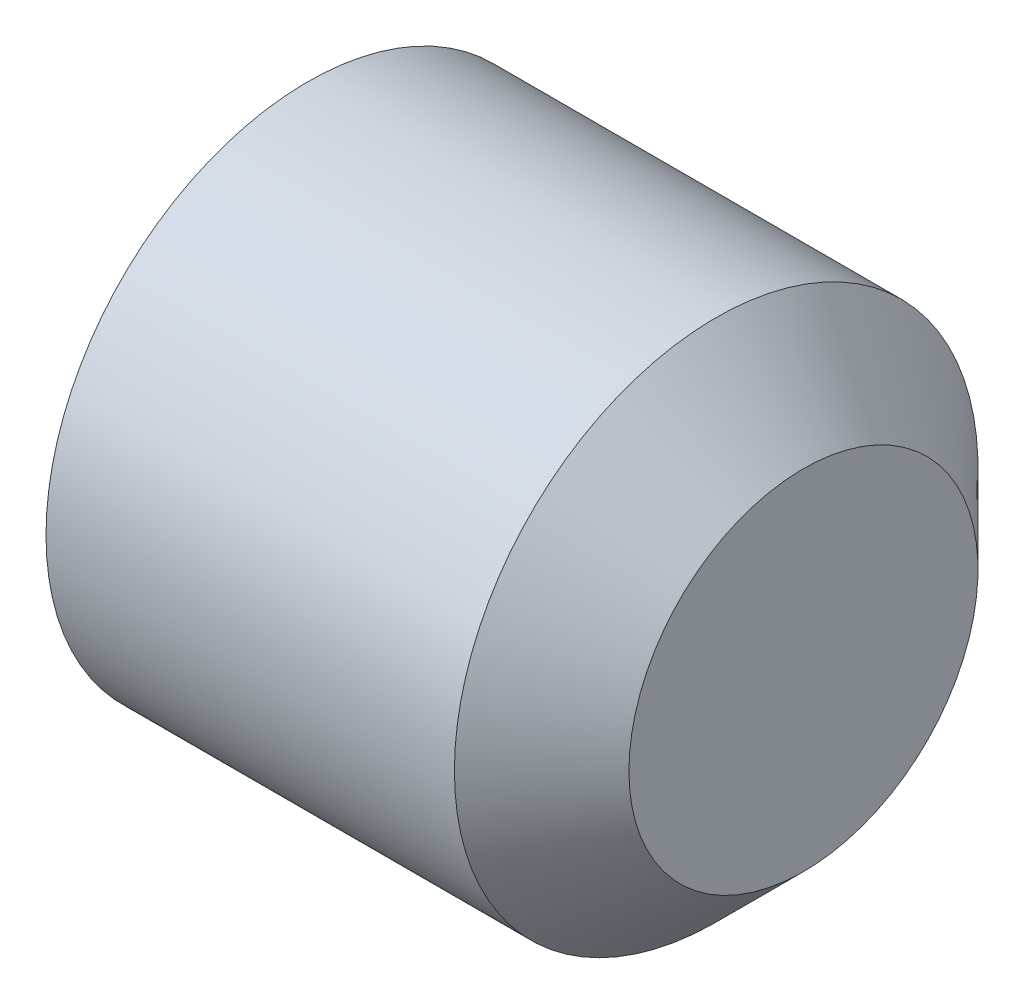
ISO-10303-21;
HEADER;
FILE_DESCRIPTION(('STEP AP214'),'2;1');
FILE_NAME('part.step','',(''),(''),'','','');
FILE_SCHEMA(('AUTOMOTIVE_DESIGN { 1 0 10303 214 1 1 1 1 }'));
ENDSEC;
DATA;
#1=APPLICATION_CONTEXT('core data for automotive mechanical design processes');
#2=APPLICATION_PROTOCOL_DEFINITION('international standard','automotive_design',2000,#1);
#3=PRODUCT_CONTEXT('',#1,'mechanical');
#4=PRODUCT('Part','Part','',(#3));
#5=PRODUCT_RELATED_PRODUCT_CATEGORY('part','',(#4));
#6=PRODUCT_DEFINITION_FORMATION('','',#4);
#7=PRODUCT_DEFINITION_CONTEXT('part definition',#1,'design');
#8=PRODUCT_DEFINITION('design','',#6,#7);
#9=PRODUCT_DEFINITION_SHAPE('','',#8);
#10=(LENGTH_UNIT() NAMED_UNIT(*) SI_UNIT(.MILLI.,.METRE.));
#11=(NAMED_UNIT(*) PLANE_ANGLE_UNIT() SI_UNIT($,.RADIAN.));
#12=(NAMED_UNIT(*) SI_UNIT($,.STERADIAN.) SOLID_ANGLE_UNIT());
#13=UNCERTAINTY_MEASURE_WITH_UNIT(LENGTH_MEASURE(1.E-05),#10,'distance_accuracy_value','');
#14=(GEOMETRIC_REPRESENTATION_CONTEXT(3) GLOBAL_UNCERTAINTY_ASSIGNED_CONTEXT((#13)) GLOBAL_UNIT_ASSIGNED_CONTEXT((#10,
#11,#12)) REPRESENTATION_CONTEXT('',''));
#15=CARTESIAN_POINT('',(0.,0.,0.));
#16=DIRECTION('',(0.,0.,1.));
#17=DIRECTION('',(1.,0.,0.));
#18=AXIS2_PLACEMENT_3D('',#15,#16,#17);
#19=CARTESIAN_POINT('',(0.,0.,0.));
#20=DIRECTION('',(-1.,0.,0.));
#21=DIRECTION('',(0.,0.,1.));
#22=AXIS2_PLACEMENT_3D('',#19,#20,#21);
#23=PLANE('',#22);
#24=CARTESIAN_POINT('',(0.,0.,0.));
#25=DIRECTION('',(-1.,0.,0.));
#26=DIRECTION('',(0.,0.,1.));
#27=AXIS2_PLACEMENT_3D('',#24,#25,#26);
#28=CIRCLE('',#27,2.44550000002553);
#29=CARTESIAN_POINT('',(0.,0.,2.44550000002553));
#30=VERTEX_POINT('',#29);
#31=EDGE_CURVE('E45',#30,#30,#28,.T.);
#32=ORIENTED_EDGE('',*,*,#31,.T.);
#33=EDGE_LOOP('',(#32));
#34=FACE_BOUND('',#33,.T.);
#35=DIRECTION('',(0.,0.866025403784439,0.5));
#36=VECTOR('',#35,1.);
#37=CARTESIAN_POINT('',(0.,-1.49999999999999,0.866025403784435));
#38=LINE('',#37,#36);
#39=CARTESIAN_POINT('',(0.,-1.49999999999999,0.866025403784435));
#40=VERTEX_POINT('',#39);
#41=CARTESIAN_POINT('',(0.,0.,1.73205080756887));
#42=VERTEX_POINT('',#41);
#43=EDGE_CURVE('E52',#40,#42,#38,.T.);
#44=ORIENTED_EDGE('',*,*,#43,.F.);
#45=DIRECTION('',(0.,0.,1.));
#46=VECTOR('',#45,1.);
#47=CARTESIAN_POINT('',(0.,-1.49999999999999,-0.866025403784441));
#48=LINE('',#47,#46);
#49=CARTESIAN_POINT('',(0.,-1.49999999999999,-0.866025403784441));
#50=VERTEX_POINT('',#49);
#51=EDGE_CURVE('E135',#50,#40,#48,.T.);
#52=ORIENTED_EDGE('',*,*,#51,.F.);
#53=DIRECTION('',(0.,-0.866025403784438,0.500000000000001));
#54=VECTOR('',#53,1.);
#55=CARTESIAN_POINT('',(0.,0.,-1.73205080756888));
#56=LINE('',#55,#54);
#57=CARTESIAN_POINT('',(0.,0.,-1.73205080756888));
#58=VERTEX_POINT('',#57);
#59=EDGE_CURVE('E133',#58,#50,#56,.T.);
#60=ORIENTED_EDGE('',*,*,#59,.F.);
#61=DIRECTION('',(0.,-0.866025403784439,-0.5));
#62=VECTOR('',#61,1.);
#63=CARTESIAN_POINT('',(0.,1.5,-0.866025403784442));
#64=LINE('',#63,#62);
#65=CARTESIAN_POINT('',(0.,1.5,-0.866025403784442));
#66=VERTEX_POINT('',#65);
#67=EDGE_CURVE('E100',#66,#58,#64,.T.);
#68=ORIENTED_EDGE('',*,*,#67,.F.);
#69=DIRECTION('',(0.,0.,-1.));
#70=VECTOR('',#69,1.);
#71=CARTESIAN_POINT('',(0.,1.5,0.866025403784434));
#72=LINE('',#71,#70);
#73=CARTESIAN_POINT('',(0.,1.5,0.866025403784434));
#74=VERTEX_POINT('',#73);
#75=EDGE_CURVE('E129',#74,#66,#72,.T.);
#76=ORIENTED_EDGE('',*,*,#75,.F.);
#77=DIRECTION('',(0.,0.866025403784438,-0.5));
#78=VECTOR('',#77,1.);
#79=CARTESIAN_POINT('',(0.,0.,1.73205080756887));
#80=LINE('',#79,#78);
#81=EDGE_CURVE('E126',#42,#74,#80,.T.);
#82=ORIENTED_EDGE('',*,*,#81,.F.);
#83=EDGE_LOOP('',(#44,#52,#60,#68,#76,#82));
#84=FACE_BOUND('',#83,.T.);
#85=ADVANCED_FACE('F37',(#34,#84),#23,.T.);
#86=CARTESIAN_POINT('',(6.,0.,0.));
#87=DIRECTION('',(-1.,0.,0.));
#88=DIRECTION('',(0.,0.,1.));
#89=AXIS2_PLACEMENT_3D('',#86,#87,#88);
#90=CYLINDRICAL_SURFACE('',#89,3.00000000000659);
#91=CARTESIAN_POINT('',(0.320140724260976,0.,0.));
#92=DIRECTION('',(-1.,0.,0.));
#93=DIRECTION('',(0.,0.,1.));
#94=AXIS2_PLACEMENT_3D('',#91,#92,#93);
#95=CIRCLE('',#94,3.00000000000659);
#96=CARTESIAN_POINT('',(0.320140724260976,0.,3.00000000000659));
#97=VERTEX_POINT('',#96);
#98=EDGE_CURVE('E11',#97,#97,#95,.F.);
#99=ORIENTED_EDGE('',*,*,#98,.T.);
#100=EDGE_LOOP('',(#99));
#101=FACE_BOUND('',#100,.T.);
#102=CARTESIAN_POINT('',(4.99999999999341,0.,0.));
#103=DIRECTION('',(-1.,0.,0.));
#104=DIRECTION('',(0.,0.,1.));
#105=AXIS2_PLACEMENT_3D('',#102,#103,#104);
#106=CIRCLE('',#105,3.00000000000659);
#107=CARTESIAN_POINT('',(4.99999999999341,0.,3.00000000000659));
#108=VERTEX_POINT('',#107);
#109=EDGE_CURVE('E147',#108,#108,#106,.T.);
#110=ORIENTED_EDGE('',*,*,#109,.T.);
#111=EDGE_LOOP('',(#110));
#112=FACE_BOUND('',#111,.T.);
#113=ADVANCED_FACE('F163',(#101,#112),#90,.T.);
#114=CARTESIAN_POINT('',(4.99999999999341,0.,0.));
#115=DIRECTION('',(-1.,0.,0.));
#116=DIRECTION('',(0.,0.,1.));
#117=AXIS2_PLACEMENT_3D('',#114,#115,#116);
#118=CONICAL_SURFACE('',#117,3.00000000000659,0.78539816339745);
#119=CARTESIAN_POINT('',(6.,0.,0.));
#120=DIRECTION('',(-1.,0.,0.));
#121=DIRECTION('',(0.,0.,1.));
#122=AXIS2_PLACEMENT_3D('',#119,#120,#121);
#123=CIRCLE('',#122,2.);
#124=CARTESIAN_POINT('',(6.,0.,2.));
#125=VERTEX_POINT('',#124);
#126=EDGE_CURVE('E139',#125,#125,#123,.T.);
#127=ORIENTED_EDGE('',*,*,#126,.T.);
#128=EDGE_LOOP('',(#127));
#129=FACE_BOUND('',#128,.T.);
#130=ORIENTED_EDGE('',*,*,#109,.F.);
#131=EDGE_LOOP('',(#130));
#132=FACE_BOUND('',#131,.T.);
#133=ADVANCED_FACE('F167',(#129,#132),#118,.T.);
#134=CARTESIAN_POINT('',(6.,2.,0.));
#135=DIRECTION('',(1.,0.,0.));
#136=DIRECTION('',(0.,0.,-1.));
#137=AXIS2_PLACEMENT_3D('',#134,#135,#136);
#138=PLANE('',#137);
#139=ORIENTED_EDGE('',*,*,#126,.F.);
#140=EDGE_LOOP('',(#139));
#141=FACE_BOUND('',#140,.T.);
#142=ADVANCED_FACE('F173',(#141),#138,.T.);
#143=CARTESIAN_POINT('',(2.,-1.49999999999999,0.866025403784435));
#144=DIRECTION('',(0.,-0.5,0.866025403784439));
#145=DIRECTION('',(0.,-0.866025403784439,-0.5));
#146=AXIS2_PLACEMENT_3D('',#143,#144,#145);
#147=PLANE('',#146);
#148=ORIENTED_EDGE('',*,*,#43,.T.);
#149=DIRECTION('',(-1.,0.,0.));
#150=VECTOR('',#149,1.);
#151=CARTESIAN_POINT('',(2.,0.,1.73205080756887));
#152=LINE('',#151,#150);
#153=CARTESIAN_POINT('',(2.,0.,1.73205080756887));
#154=VERTEX_POINT('',#153);
#155=EDGE_CURVE('E82',#154,#42,#152,.T.);
#156=ORIENTED_EDGE('',*,*,#155,.F.);
#157=DIRECTION('',(0.,0.866025403784439,0.5));
#158=VECTOR('',#157,1.);
#159=CARTESIAN_POINT('',(2.,-1.49999999999999,0.866025403784435));
#160=LINE('',#159,#158);
#161=CARTESIAN_POINT('',(2.,-1.49999999999999,0.866025403784435));
#162=VERTEX_POINT('',#161);
#163=EDGE_CURVE('E137',#162,#154,#160,.T.);
#164=ORIENTED_EDGE('',*,*,#163,.F.);
#165=DIRECTION('',(-1.,0.,0.));
#166=VECTOR('',#165,1.);
#167=CARTESIAN_POINT('',(2.,-1.49999999999999,0.866025403784435));
#168=LINE('',#167,#166);
#169=EDGE_CURVE('E60',#162,#40,#168,.T.);
#170=ORIENTED_EDGE('',*,*,#169,.T.);
#171=EDGE_LOOP('',(#148,#156,#164,#170));
#172=FACE_BOUND('',#171,.T.);
#173=ADVANCED_FACE('F177',(#172),#147,.F.);
#174=CARTESIAN_POINT('',(2.,-1.49999999999999,-0.866025403784441));
#175=DIRECTION('',(0.,-1.,0.));
#176=DIRECTION('',(0.,0.,-1.));
#177=AXIS2_PLACEMENT_3D('',#174,#175,#176);
#178=PLANE('',#177);
#179=ORIENTED_EDGE('',*,*,#51,.T.);
#180=ORIENTED_EDGE('',*,*,#169,.F.);
#181=DIRECTION('',(0.,0.,1.));
#182=VECTOR('',#181,1.);
#183=CARTESIAN_POINT('',(2.,-1.49999999999999,-0.866025403784441));
#184=LINE('',#183,#182);
#185=CARTESIAN_POINT('',(2.,-1.49999999999999,-0.866025403784441));
#186=VERTEX_POINT('',#185);
#187=EDGE_CURVE('E112',#186,#162,#184,.T.);
#188=ORIENTED_EDGE('',*,*,#187,.F.);
#189=DIRECTION('',(-1.,0.,0.));
#190=VECTOR('',#189,1.);
#191=CARTESIAN_POINT('',(2.,-1.49999999999999,-0.866025403784441));
#192=LINE('',#191,#190);
#193=EDGE_CURVE('E104',#186,#50,#192,.T.);
#194=ORIENTED_EDGE('',*,*,#193,.T.);
#195=EDGE_LOOP('',(#179,#180,#188,#194));
#196=FACE_BOUND('',#195,.T.);
#197=ADVANCED_FACE('F181',(#196),#178,.F.);
#198=CARTESIAN_POINT('',(2.,0.,-1.73205080756888));
#199=DIRECTION('',(0.,-0.500000000000001,-0.866025403784438));
#200=DIRECTION('',(0.,0.866025403784438,-0.500000000000001));
#201=AXIS2_PLACEMENT_3D('',#198,#199,#200);
#202=PLANE('',#201);
#203=ORIENTED_EDGE('',*,*,#59,.T.);
#204=ORIENTED_EDGE('',*,*,#193,.F.);
#205=DIRECTION('',(0.,-0.866025403784438,0.500000000000001));
#206=VECTOR('',#205,1.);
#207=CARTESIAN_POINT('',(2.,0.,-1.73205080756888));
#208=LINE('',#207,#206);
#209=CARTESIAN_POINT('',(2.,0.,-1.73205080756888));
#210=VERTEX_POINT('',#209);
#211=EDGE_CURVE('E108',#210,#186,#208,.T.);
#212=ORIENTED_EDGE('',*,*,#211,.F.);
#213=DIRECTION('',(-1.,0.,0.));
#214=VECTOR('',#213,1.);
#215=CARTESIAN_POINT('',(2.,0.,-1.73205080756888));
#216=LINE('',#215,#214);
#217=EDGE_CURVE('E93',#210,#58,#216,.T.);
#218=ORIENTED_EDGE('',*,*,#217,.T.);
#219=EDGE_LOOP('',(#203,#204,#212,#218));
#220=FACE_BOUND('',#219,.T.);
#221=ADVANCED_FACE('F109',(#220),#202,.F.);
#222=CARTESIAN_POINT('',(2.,1.5,-0.866025403784442));
#223=DIRECTION('',(0.,0.5,-0.866025403784439));
#224=DIRECTION('',(0.,0.866025403784439,0.5));
#225=AXIS2_PLACEMENT_3D('',#222,#223,#224);
#226=PLANE('',#225);
#227=ORIENTED_EDGE('',*,*,#67,.T.);
#228=ORIENTED_EDGE('',*,*,#217,.F.);
#229=DIRECTION('',(0.,-0.866025403784439,-0.5));
#230=VECTOR('',#229,1.);
#231=CARTESIAN_POINT('',(2.,1.5,-0.866025403784442));
#232=LINE('',#231,#230);
#233=CARTESIAN_POINT('',(2.,1.5,-0.866025403784442));
#234=VERTEX_POINT('',#233);
#235=EDGE_CURVE('E97',#234,#210,#232,.T.);
#236=ORIENTED_EDGE('',*,*,#235,.F.);
#237=DIRECTION('',(-1.,0.,0.));
#238=VECTOR('',#237,1.);
#239=CARTESIAN_POINT('',(2.,1.5,-0.866025403784442));
#240=LINE('',#239,#238);
#241=EDGE_CURVE('E105',#234,#66,#240,.T.);
#242=ORIENTED_EDGE('',*,*,#241,.T.);
#243=EDGE_LOOP('',(#227,#228,#236,#242));
#244=FACE_BOUND('',#243,.T.);
#245=ADVANCED_FACE('F95',(#244),#226,.F.);
#246=CARTESIAN_POINT('',(2.,1.5,0.866025403784434));
#247=DIRECTION('',(0.,1.,0.));
#248=DIRECTION('',(0.,0.,1.));
#249=AXIS2_PLACEMENT_3D('',#246,#247,#248);
#250=PLANE('',#249);
#251=ORIENTED_EDGE('',*,*,#75,.T.);
#252=ORIENTED_EDGE('',*,*,#241,.F.);
#253=DIRECTION('',(0.,0.,-1.));
#254=VECTOR('',#253,1.);
#255=CARTESIAN_POINT('',(2.,1.5,0.866025403784434));
#256=LINE('',#255,#254);
#257=CARTESIAN_POINT('',(2.,1.5,0.866025403784434));
#258=VERTEX_POINT('',#257);
#259=EDGE_CURVE('E118',#258,#234,#256,.T.);
#260=ORIENTED_EDGE('',*,*,#259,.F.);
#261=DIRECTION('',(-1.,0.,0.));
#262=VECTOR('',#261,1.);
#263=CARTESIAN_POINT('',(2.,1.5,0.866025403784434));
#264=LINE('',#263,#262);
#265=EDGE_CURVE('E142',#258,#74,#264,.T.);
#266=ORIENTED_EDGE('',*,*,#265,.T.);
#267=EDGE_LOOP('',(#251,#252,#260,#266));
#268=FACE_BOUND('',#267,.T.);
#269=ADVANCED_FACE('F184',(#268),#250,.F.);
#270=CARTESIAN_POINT('',(2.,0.,1.73205080756887));
#271=DIRECTION('',(0.,0.5,0.866025403784438));
#272=DIRECTION('',(0.,-0.866025403784438,0.5));
#273=AXIS2_PLACEMENT_3D('',#270,#271,#272);
#274=PLANE('',#273);
#275=ORIENTED_EDGE('',*,*,#81,.T.);
#276=ORIENTED_EDGE('',*,*,#265,.F.);
#277=DIRECTION('',(0.,0.866025403784438,-0.5));
#278=VECTOR('',#277,1.);
#279=CARTESIAN_POINT('',(2.,0.,1.73205080756887));
#280=LINE('',#279,#278);
#281=EDGE_CURVE('E120',#154,#258,#280,.T.);
#282=ORIENTED_EDGE('',*,*,#281,.F.);
#283=ORIENTED_EDGE('',*,*,#155,.T.);
#284=EDGE_LOOP('',(#275,#276,#282,#283));
#285=FACE_BOUND('',#284,.T.);
#286=ADVANCED_FACE('F159',(#285),#274,.F.);
#287=CARTESIAN_POINT('',(2.,0.,0.));
#288=DIRECTION('',(-1.,0.,0.));
#289=DIRECTION('',(0.,0.,1.));
#290=AXIS2_PLACEMENT_3D('',#287,#288,#289);
#291=PLANE('',#290);
#292=ORIENTED_EDGE('',*,*,#163,.T.);
#293=ORIENTED_EDGE('',*,*,#281,.T.);
#294=ORIENTED_EDGE('',*,*,#259,.T.);
#295=ORIENTED_EDGE('',*,*,#235,.T.);
#296=ORIENTED_EDGE('',*,*,#211,.T.);
#297=ORIENTED_EDGE('',*,*,#187,.T.);
#298=EDGE_LOOP('',(#292,#293,#294,#295,#296,#297));
#299=FACE_BOUND('',#298,.T.);
#300=ADVANCED_FACE('F115',(#299),#291,.T.);
#301=CARTESIAN_POINT('',(0.,0.,0.));
#302=DIRECTION('',(1.,0.,0.));
#303=DIRECTION('',(0.,0.,-1.));
#304=AXIS2_PLACEMENT_3D('',#301,#302,#303);
#305=CONICAL_SURFACE('',#304,2.44550000002553,1.04719755118812);
#306=ORIENTED_EDGE('',*,*,#98,.F.);
#307=EDGE_LOOP('',(#306));
#308=FACE_BOUND('',#307,.T.);
#309=ORIENTED_EDGE('',*,*,#31,.F.);
#310=EDGE_LOOP('',(#309));
#311=FACE_BOUND('',#310,.T.);
#312=ADVANCED_FACE('F39',(#308,#311),#305,.T.);
#313=CLOSED_SHELL('',(#85,#113,#133,#142,#173,#197,#221,#245,#269,#286,#300,#312));
#314=MANIFOLD_SOLID_BREP('B2',#313);
#315=ADVANCED_BREP_SHAPE_REPRESENTATION('',(#18,#314),#14);
#316=SHAPE_DEFINITION_REPRESENTATION(#9,#315);
ENDSEC;
END-ISO-10303-21;
